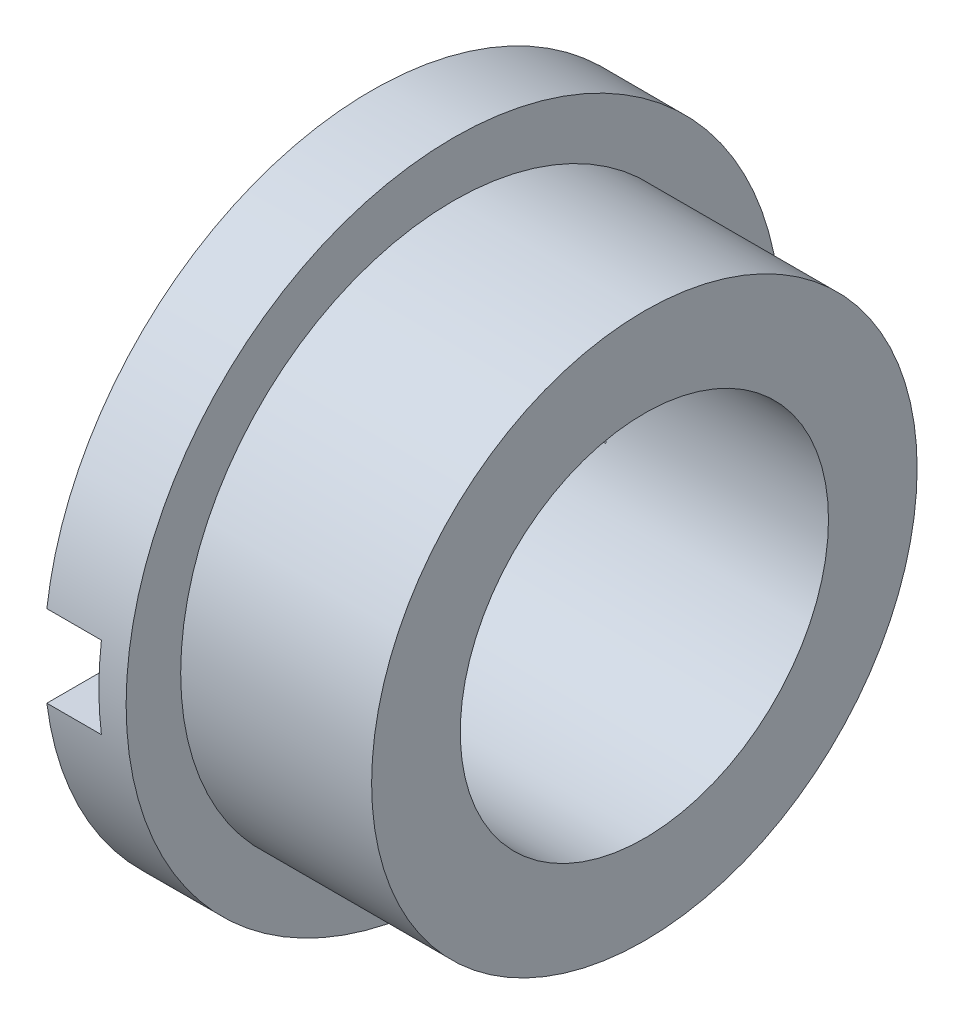
ISO-10303-21;
HEADER;
FILE_DESCRIPTION(('STEP AP214'),'2;1');
FILE_NAME('part.step','',(''),(''),'','','');
FILE_SCHEMA(('AUTOMOTIVE_DESIGN { 1 0 10303 214 1 1 1 1 }'));
ENDSEC;
DATA;
#1=APPLICATION_CONTEXT('core data for automotive mechanical design processes');
#2=APPLICATION_PROTOCOL_DEFINITION('international standard','automotive_design',2000,#1);
#3=PRODUCT_CONTEXT('',#1,'mechanical');
#4=PRODUCT('Part','Part','',(#3));
#5=PRODUCT_RELATED_PRODUCT_CATEGORY('part','',(#4));
#6=PRODUCT_DEFINITION_FORMATION('','',#4);
#7=PRODUCT_DEFINITION_CONTEXT('part definition',#1,'design');
#8=PRODUCT_DEFINITION('design','',#6,#7);
#9=PRODUCT_DEFINITION_SHAPE('','',#8);
#10=(LENGTH_UNIT() NAMED_UNIT(*) SI_UNIT(.MILLI.,.METRE.));
#11=(NAMED_UNIT(*) PLANE_ANGLE_UNIT() SI_UNIT($,.RADIAN.));
#12=(NAMED_UNIT(*) SI_UNIT($,.STERADIAN.) SOLID_ANGLE_UNIT());
#13=UNCERTAINTY_MEASURE_WITH_UNIT(LENGTH_MEASURE(1.E-05),#10,'distance_accuracy_value','');
#14=(GEOMETRIC_REPRESENTATION_CONTEXT(3) GLOBAL_UNCERTAINTY_ASSIGNED_CONTEXT((#13)) GLOBAL_UNIT_ASSIGNED_CONTEXT((#10,
#11,#12)) REPRESENTATION_CONTEXT('',''));
#15=CARTESIAN_POINT('',(0.,0.,0.));
#16=DIRECTION('',(0.,0.,1.));
#17=DIRECTION('',(1.,0.,0.));
#18=AXIS2_PLACEMENT_3D('',#15,#16,#17);
#19=CARTESIAN_POINT('',(-1.5,0.,0.));
#20=DIRECTION('',(1.,0.,0.));
#21=DIRECTION('',(0.,0.,-1.));
#22=AXIS2_PLACEMENT_3D('',#19,#20,#21);
#23=PLANE('',#22);
#24=CARTESIAN_POINT('',(-1.5,0.,0.));
#25=DIRECTION('',(1.,0.,0.));
#26=DIRECTION('',(0.,0.,-1.));
#27=AXIS2_PLACEMENT_3D('',#24,#25,#26);
#28=CIRCLE('',#27,6.);
#29=CARTESIAN_POINT('',(-1.5,0.75,5.95294044989533));
#30=VERTEX_POINT('',#29);
#31=CARTESIAN_POINT('',(-1.5,0.75,-5.95294044989533));
#32=VERTEX_POINT('',#31);
#33=EDGE_CURVE('E126',#30,#32,#28,.F.);
#34=ORIENTED_EDGE('',*,*,#33,.T.);
#35=DIRECTION('',(0.,0.,1.));
#36=VECTOR('',#35,1.);
#37=CARTESIAN_POINT('',(-1.5,0.75,-6.));
#38=LINE('',#37,#36);
#39=CARTESIAN_POINT('',(-1.5,0.75,-3.29061164527205));
#40=VERTEX_POINT('',#39);
#41=EDGE_CURVE('E100',#32,#40,#38,.T.);
#42=ORIENTED_EDGE('',*,*,#41,.T.);
#43=CARTESIAN_POINT('',(-1.5,0.,0.));
#44=DIRECTION('',(1.,0.,0.));
#45=DIRECTION('',(0.,0.,-1.));
#46=AXIS2_PLACEMENT_3D('',#43,#44,#45);
#47=CIRCLE('',#46,3.375);
#48=CARTESIAN_POINT('',(-1.5,0.75,3.29061164527205));
#49=VERTEX_POINT('',#48);
#50=EDGE_CURVE('E136',#40,#49,#47,.T.);
#51=ORIENTED_EDGE('',*,*,#50,.T.);
#52=EDGE_CURVE('E166',#49,#30,#38,.T.);
#53=ORIENTED_EDGE('',*,*,#52,.T.);
#54=EDGE_LOOP('',(#34,#42,#51,#53));
#55=FACE_BOUND('',#54,.T.);
#56=ADVANCED_FACE('F27',(#55),#23,.F.);
#57=CARTESIAN_POINT('',(3.5,0.,0.));
#58=DIRECTION('',(1.,0.,0.));
#59=DIRECTION('',(0.,0.,-1.));
#60=AXIS2_PLACEMENT_3D('',#57,#58,#59);
#61=PLANE('',#60);
#62=CARTESIAN_POINT('',(3.5,0.,0.));
#63=DIRECTION('',(1.,0.,0.));
#64=DIRECTION('',(0.,0.,-1.));
#65=AXIS2_PLACEMENT_3D('',#62,#63,#64);
#66=CIRCLE('',#65,5.);
#67=CARTESIAN_POINT('',(3.5,0.,-5.));
#68=VERTEX_POINT('',#67);
#69=EDGE_CURVE('E142',#68,#68,#66,.T.);
#70=ORIENTED_EDGE('',*,*,#69,.T.);
#71=EDGE_LOOP('',(#70));
#72=FACE_BOUND('',#71,.T.);
#73=CARTESIAN_POINT('',(3.5,0.,0.));
#74=DIRECTION('',(1.,0.,0.));
#75=DIRECTION('',(0.,0.,-1.));
#76=AXIS2_PLACEMENT_3D('',#73,#74,#75);
#77=CIRCLE('',#76,3.375);
#78=CARTESIAN_POINT('',(3.5,0.,-3.375));
#79=VERTEX_POINT('',#78);
#80=EDGE_CURVE('E139',#79,#79,#77,.T.);
#81=ORIENTED_EDGE('',*,*,#80,.F.);
#82=EDGE_LOOP('',(#81));
#83=FACE_BOUND('',#82,.T.);
#84=ADVANCED_FACE('F187',(#72,#83),#61,.T.);
#85=CARTESIAN_POINT('',(3.5,0.,0.));
#86=DIRECTION('',(-1.,0.,0.));
#87=DIRECTION('',(0.,0.,1.));
#88=AXIS2_PLACEMENT_3D('',#85,#86,#87);
#89=CYLINDRICAL_SURFACE('',#88,5.);
#90=CARTESIAN_POINT('',(0.,0.,0.));
#91=DIRECTION('',(1.,0.,0.));
#92=DIRECTION('',(0.,0.,-1.));
#93=AXIS2_PLACEMENT_3D('',#90,#91,#92);
#94=CIRCLE('',#93,5.);
#95=CARTESIAN_POINT('',(0.,0.,-5.));
#96=VERTEX_POINT('',#95);
#97=EDGE_CURVE('E132',#96,#96,#94,.T.);
#98=ORIENTED_EDGE('',*,*,#97,.T.);
#99=EDGE_LOOP('',(#98));
#100=FACE_BOUND('',#99,.T.);
#101=ORIENTED_EDGE('',*,*,#69,.F.);
#102=EDGE_LOOP('',(#101));
#103=FACE_BOUND('',#102,.T.);
#104=ADVANCED_FACE('F29',(#100,#103),#89,.T.);
#105=CARTESIAN_POINT('',(3.5,0.,0.));
#106=DIRECTION('',(-1.,0.,0.));
#107=DIRECTION('',(0.,0.,1.));
#108=AXIS2_PLACEMENT_3D('',#105,#106,#107);
#109=CYLINDRICAL_SURFACE('',#108,3.375);
#110=DIRECTION('',(-1.,0.,0.));
#111=VECTOR('',#110,1.);
#112=CARTESIAN_POINT('',(3.5,0.75,3.29061164527205));
#113=LINE('',#112,#111);
#114=CARTESIAN_POINT('',(-0.500000000000002,0.749999999999999,3.29061164527205));
#115=VERTEX_POINT('',#114);
#116=EDGE_CURVE('E120',#49,#115,#113,.F.);
#117=ORIENTED_EDGE('',*,*,#116,.F.);
#118=ORIENTED_EDGE('',*,*,#50,.F.);
#119=DIRECTION('',(-1.,0.,0.));
#120=VECTOR('',#119,1.);
#121=CARTESIAN_POINT('',(3.5,0.75,-3.29061164527205));
#122=LINE('',#121,#120);
#123=CARTESIAN_POINT('',(-0.500000000000002,0.749999999999999,-3.29061164527205));
#124=VERTEX_POINT('',#123);
#125=EDGE_CURVE('E117',#124,#40,#122,.T.);
#126=ORIENTED_EDGE('',*,*,#125,.F.);
#127=CARTESIAN_POINT('',(-0.500000000000002,0.,0.));
#128=DIRECTION('',(1.,0.,0.));
#129=DIRECTION('',(0.,1.,0.));
#130=AXIS2_PLACEMENT_3D('',#127,#128,#129);
#131=CIRCLE('',#130,3.375);
#132=CARTESIAN_POINT('',(-0.500000000000001,-0.75,-3.29061164527205));
#133=VERTEX_POINT('',#132);
#134=EDGE_CURVE('E105',#133,#124,#131,.T.);
#135=ORIENTED_EDGE('',*,*,#134,.F.);
#136=DIRECTION('',(-1.,0.,0.));
#137=VECTOR('',#136,1.);
#138=CARTESIAN_POINT('',(3.5,-0.749999999999999,-3.29061164527205));
#139=LINE('',#138,#137);
#140=CARTESIAN_POINT('',(-1.5,-0.75,-3.29061164527205));
#141=VERTEX_POINT('',#140);
#142=EDGE_CURVE('E91',#141,#133,#139,.F.);
#143=ORIENTED_EDGE('',*,*,#142,.F.);
#144=CARTESIAN_POINT('',(-1.5,-0.75,3.29061164527205));
#145=VERTEX_POINT('',#144);
#146=EDGE_CURVE('E135',#145,#141,#47,.T.);
#147=ORIENTED_EDGE('',*,*,#146,.F.);
#148=DIRECTION('',(-1.,0.,0.));
#149=VECTOR('',#148,1.);
#150=CARTESIAN_POINT('',(3.5,-0.749999999999999,3.29061164527205));
#151=LINE('',#150,#149);
#152=CARTESIAN_POINT('',(-0.500000000000001,-0.75,3.29061164527205));
#153=VERTEX_POINT('',#152);
#154=EDGE_CURVE('E99',#153,#145,#151,.T.);
#155=ORIENTED_EDGE('',*,*,#154,.F.);
#156=EDGE_CURVE('E118',#115,#153,#131,.T.);
#157=ORIENTED_EDGE('',*,*,#156,.F.);
#158=EDGE_LOOP('',(#117,#118,#126,#135,#143,#147,#155,#157));
#159=FACE_BOUND('',#158,.T.);
#160=ORIENTED_EDGE('',*,*,#80,.T.);
#161=EDGE_LOOP('',(#160));
#162=FACE_BOUND('',#161,.T.);
#163=ADVANCED_FACE('F114',(#159,#162),#109,.F.);
#164=CARTESIAN_POINT('',(-1.5,-0.75,-5.95294044989533));
#165=VERTEX_POINT('',#164);
#166=CARTESIAN_POINT('',(-1.5,-0.750000000000004,5.95294044989533));
#167=VERTEX_POINT('',#166);
#168=EDGE_CURVE('E129',#165,#167,#28,.F.);
#169=ORIENTED_EDGE('',*,*,#168,.T.);
#170=DIRECTION('',(0.,0.,1.));
#171=VECTOR('',#170,1.);
#172=CARTESIAN_POINT('',(-1.5,-0.75,-6.));
#173=LINE('',#172,#171);
#174=EDGE_CURVE('E50',#145,#167,#173,.T.);
#175=ORIENTED_EDGE('',*,*,#174,.F.);
#176=ORIENTED_EDGE('',*,*,#146,.T.);
#177=EDGE_CURVE('E94',#165,#141,#173,.T.);
#178=ORIENTED_EDGE('',*,*,#177,.F.);
#179=EDGE_LOOP('',(#169,#175,#176,#178));
#180=FACE_BOUND('',#179,.T.);
#181=ADVANCED_FACE('F189',(#180),#23,.F.);
#182=CARTESIAN_POINT('',(0.,0.,0.));
#183=DIRECTION('',(1.,0.,0.));
#184=DIRECTION('',(0.,0.,-1.));
#185=AXIS2_PLACEMENT_3D('',#182,#183,#184);
#186=PLANE('',#185);
#187=CARTESIAN_POINT('',(0.,0.,0.));
#188=DIRECTION('',(1.,0.,0.));
#189=DIRECTION('',(0.,0.,-1.));
#190=AXIS2_PLACEMENT_3D('',#187,#188,#189);
#191=CIRCLE('',#190,6.);
#192=CARTESIAN_POINT('',(0.,0.,-6.));
#193=VERTEX_POINT('',#192);
#194=EDGE_CURVE('E125',#193,#193,#191,.T.);
#195=ORIENTED_EDGE('',*,*,#194,.T.);
#196=EDGE_LOOP('',(#195));
#197=FACE_BOUND('',#196,.T.);
#198=ORIENTED_EDGE('',*,*,#97,.F.);
#199=EDGE_LOOP('',(#198));
#200=FACE_BOUND('',#199,.T.);
#201=ADVANCED_FACE('F199',(#197,#200),#186,.T.);
#202=CARTESIAN_POINT('',(-18.4705627484771,0.,0.));
#203=DIRECTION('',(1.,0.,0.));
#204=DIRECTION('',(0.,0.,-1.));
#205=AXIS2_PLACEMENT_3D('',#202,#203,#204);
#206=CYLINDRICAL_SURFACE('',#205,6.);
#207=DIRECTION('',(1.,0.,0.));
#208=VECTOR('',#207,1.);
#209=CARTESIAN_POINT('',(-18.4705627484771,0.75,-5.95294044989533));
#210=LINE('',#209,#208);
#211=CARTESIAN_POINT('',(-0.500000000000001,0.749999999999999,-5.95294044989533));
#212=VERTEX_POINT('',#211);
#213=EDGE_CURVE('E11',#32,#212,#210,.T.);
#214=ORIENTED_EDGE('',*,*,#213,.F.);
#215=ORIENTED_EDGE('',*,*,#33,.F.);
#216=DIRECTION('',(1.,0.,0.));
#217=VECTOR('',#216,1.);
#218=CARTESIAN_POINT('',(-18.4705627484771,0.75,5.95294044989533));
#219=LINE('',#218,#217);
#220=CARTESIAN_POINT('',(-0.500000000000001,0.749999999999999,5.95294044989533));
#221=VERTEX_POINT('',#220);
#222=EDGE_CURVE('E147',#221,#30,#219,.F.);
#223=ORIENTED_EDGE('',*,*,#222,.F.);
#224=CARTESIAN_POINT('',(-0.5,0.,0.));
#225=DIRECTION('',(1.,0.,0.));
#226=DIRECTION('',(0.,1.,0.));
#227=AXIS2_PLACEMENT_3D('',#224,#225,#226);
#228=CIRCLE('',#227,6.);
#229=CARTESIAN_POINT('',(-0.500000000000001,-0.75,5.95294044989533));
#230=VERTEX_POINT('',#229);
#231=EDGE_CURVE('E145',#230,#221,#228,.F.);
#232=ORIENTED_EDGE('',*,*,#231,.F.);
#233=DIRECTION('',(1.,0.,0.));
#234=VECTOR('',#233,1.);
#235=CARTESIAN_POINT('',(-18.4705627484771,-0.750000000000004,5.95294044989533));
#236=LINE('',#235,#234);
#237=EDGE_CURVE('E35',#167,#230,#236,.T.);
#238=ORIENTED_EDGE('',*,*,#237,.F.);
#239=ORIENTED_EDGE('',*,*,#168,.F.);
#240=DIRECTION('',(1.,0.,0.));
#241=VECTOR('',#240,1.);
#242=CARTESIAN_POINT('',(-18.4705627484771,-0.750000000000004,-5.95294044989533));
#243=LINE('',#242,#241);
#244=CARTESIAN_POINT('',(-0.5,-0.75,-5.95294044989533));
#245=VERTEX_POINT('',#244);
#246=EDGE_CURVE('E149',#245,#165,#243,.F.);
#247=ORIENTED_EDGE('',*,*,#246,.F.);
#248=EDGE_CURVE('E107',#212,#245,#228,.F.);
#249=ORIENTED_EDGE('',*,*,#248,.F.);
#250=EDGE_LOOP('',(#214,#215,#223,#232,#238,#239,#247,#249));
#251=FACE_BOUND('',#250,.T.);
#252=ORIENTED_EDGE('',*,*,#194,.F.);
#253=EDGE_LOOP('',(#252));
#254=FACE_BOUND('',#253,.T.);
#255=ADVANCED_FACE('F174',(#251,#254),#206,.T.);
#256=CARTESIAN_POINT('',(-1.5,-0.75,-6.));
#257=DIRECTION('',(0.,-1.,0.));
#258=DIRECTION('',(1.,0.,0.));
#259=AXIS2_PLACEMENT_3D('',#256,#257,#258);
#260=PLANE('',#259);
#261=ORIENTED_EDGE('',*,*,#154,.T.);
#262=ORIENTED_EDGE('',*,*,#174,.T.);
#263=ORIENTED_EDGE('',*,*,#237,.T.);
#264=DIRECTION('',(0.,0.,1.));
#265=VECTOR('',#264,1.);
#266=CARTESIAN_POINT('',(-0.500000000000001,-0.75,-6.));
#267=LINE('',#266,#265);
#268=EDGE_CURVE('E110',#153,#230,#267,.T.);
#269=ORIENTED_EDGE('',*,*,#268,.F.);
#270=EDGE_LOOP('',(#261,#262,#263,#269));
#271=FACE_BOUND('',#270,.T.);
#272=ADVANCED_FACE('F152',(#271),#260,.F.);
#273=CARTESIAN_POINT('',(-0.500000000000001,0.75,-6.));
#274=DIRECTION('',(1.,0.,0.));
#275=DIRECTION('',(0.,1.,0.));
#276=AXIS2_PLACEMENT_3D('',#273,#274,#275);
#277=PLANE('',#276);
#278=ORIENTED_EDGE('',*,*,#156,.T.);
#279=ORIENTED_EDGE('',*,*,#268,.T.);
#280=ORIENTED_EDGE('',*,*,#231,.T.);
#281=DIRECTION('',(0.,0.,1.));
#282=VECTOR('',#281,1.);
#283=CARTESIAN_POINT('',(-0.500000000000001,0.75,-6.));
#284=LINE('',#283,#282);
#285=EDGE_CURVE('E109',#115,#221,#284,.T.);
#286=ORIENTED_EDGE('',*,*,#285,.F.);
#287=EDGE_LOOP('',(#278,#279,#280,#286));
#288=FACE_BOUND('',#287,.T.);
#289=ADVANCED_FACE('F158',(#288),#277,.F.);
#290=CARTESIAN_POINT('',(-1.5,0.75,-6.));
#291=DIRECTION('',(0.,1.,0.));
#292=DIRECTION('',(0.,0.,1.));
#293=AXIS2_PLACEMENT_3D('',#290,#291,#292);
#294=PLANE('',#293);
#295=ORIENTED_EDGE('',*,*,#116,.T.);
#296=ORIENTED_EDGE('',*,*,#285,.T.);
#297=ORIENTED_EDGE('',*,*,#222,.T.);
#298=ORIENTED_EDGE('',*,*,#52,.F.);
#299=EDGE_LOOP('',(#295,#296,#297,#298));
#300=FACE_BOUND('',#299,.T.);
#301=ADVANCED_FACE('F178',(#300),#294,.F.);
#302=ORIENTED_EDGE('',*,*,#125,.T.);
#303=ORIENTED_EDGE('',*,*,#41,.F.);
#304=ORIENTED_EDGE('',*,*,#213,.T.);
#305=EDGE_CURVE('E165',#212,#124,#284,.T.);
#306=ORIENTED_EDGE('',*,*,#305,.T.);
#307=EDGE_LOOP('',(#302,#303,#304,#306));
#308=FACE_BOUND('',#307,.T.);
#309=ADVANCED_FACE('F172',(#308),#294,.F.);
#310=ORIENTED_EDGE('',*,*,#134,.T.);
#311=ORIENTED_EDGE('',*,*,#305,.F.);
#312=ORIENTED_EDGE('',*,*,#248,.T.);
#313=EDGE_CURVE('E42',#245,#133,#267,.T.);
#314=ORIENTED_EDGE('',*,*,#313,.T.);
#315=EDGE_LOOP('',(#310,#311,#312,#314));
#316=FACE_BOUND('',#315,.T.);
#317=ADVANCED_FACE('F103',(#316),#277,.F.);
#318=ORIENTED_EDGE('',*,*,#142,.T.);
#319=ORIENTED_EDGE('',*,*,#313,.F.);
#320=ORIENTED_EDGE('',*,*,#246,.T.);
#321=ORIENTED_EDGE('',*,*,#177,.T.);
#322=EDGE_LOOP('',(#318,#319,#320,#321));
#323=FACE_BOUND('',#322,.T.);
#324=ADVANCED_FACE('F92',(#323),#260,.F.);
#325=CLOSED_SHELL('',(#56,#84,#104,#163,#181,#201,#255,#272,#289,#301,#309,#317,#324));
#326=MANIFOLD_SOLID_BREP('B2',#325);
#327=ADVANCED_BREP_SHAPE_REPRESENTATION('',(#18,#326),#14);
#328=SHAPE_DEFINITION_REPRESENTATION(#9,#327);
ENDSEC;
END-ISO-10303-21;
